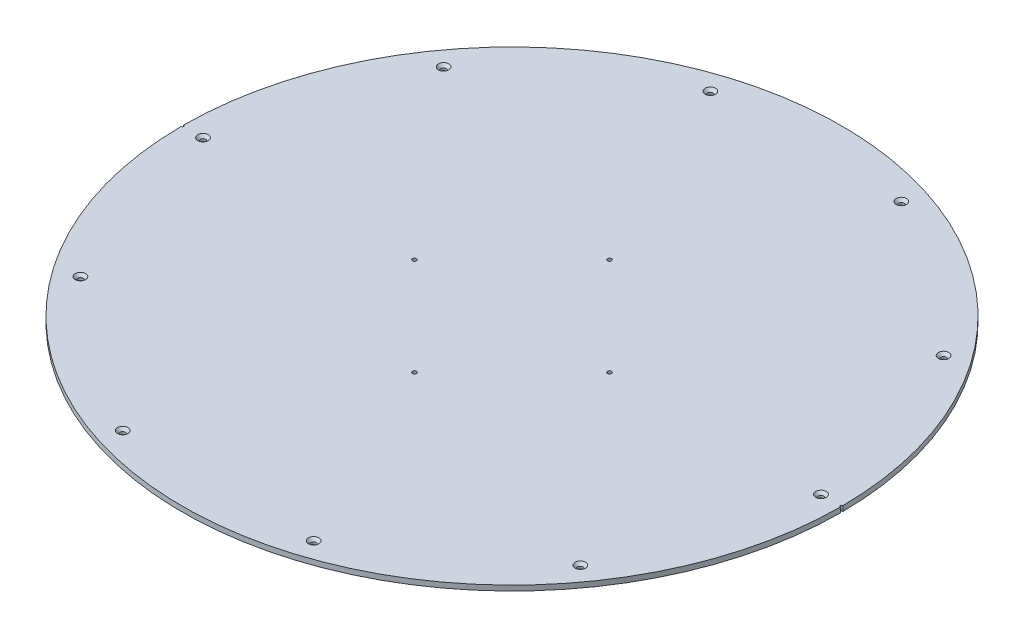
ISO-10303-21;
HEADER;
FILE_DESCRIPTION(('STEP AP214'),'2;1');
FILE_NAME('part.step','',(''),(''),'','','');
FILE_SCHEMA(('AUTOMOTIVE_DESIGN { 1 0 10303 214 1 1 1 1 }'));
ENDSEC;
DATA;
#1=APPLICATION_CONTEXT('core data for automotive mechanical design processes');
#2=APPLICATION_PROTOCOL_DEFINITION('international standard','automotive_design',2000,#1);
#3=PRODUCT_CONTEXT('',#1,'mechanical');
#4=PRODUCT('Part','Part','',(#3));
#5=PRODUCT_RELATED_PRODUCT_CATEGORY('part','',(#4));
#6=PRODUCT_DEFINITION_FORMATION('','',#4);
#7=PRODUCT_DEFINITION_CONTEXT('part definition',#1,'design');
#8=PRODUCT_DEFINITION('design','',#6,#7);
#9=PRODUCT_DEFINITION_SHAPE('','',#8);
#10=(LENGTH_UNIT() NAMED_UNIT(*) SI_UNIT(.MILLI.,.METRE.));
#11=(NAMED_UNIT(*) PLANE_ANGLE_UNIT() SI_UNIT($,.RADIAN.));
#12=(NAMED_UNIT(*) SI_UNIT($,.STERADIAN.) SOLID_ANGLE_UNIT());
#13=UNCERTAINTY_MEASURE_WITH_UNIT(LENGTH_MEASURE(1.E-05),#10,'distance_accuracy_value','');
#14=(GEOMETRIC_REPRESENTATION_CONTEXT(3) GLOBAL_UNCERTAINTY_ASSIGNED_CONTEXT((#13)) GLOBAL_UNIT_ASSIGNED_CONTEXT((#10,
#11,#12)) REPRESENTATION_CONTEXT('',''));
#15=CARTESIAN_POINT('',(0.,0.,0.));
#16=DIRECTION('',(0.,0.,1.));
#17=DIRECTION('',(1.,0.,0.));
#18=AXIS2_PLACEMENT_3D('',#15,#16,#17);
#19=CARTESIAN_POINT('',(0.,6.35,0.));
#20=DIRECTION('',(0.,-1.,0.));
#21=DIRECTION('',(0.,0.,-1.));
#22=AXIS2_PLACEMENT_3D('',#19,#20,#21);
#23=CYLINDRICAL_SURFACE('',#22,406.4);
#24=CARTESIAN_POINT('',(0.,0.,0.));
#25=DIRECTION('',(0.,1.,0.));
#26=DIRECTION('',(0.,0.,1.));
#27=AXIS2_PLACEMENT_3D('',#24,#25,#26);
#28=CIRCLE('',#27,406.4);
#29=CARTESIAN_POINT('',(406.396899414062,0.,-1.58749697208119));
#30=VERTEX_POINT('',#29);
#31=CARTESIAN_POINT('',(-406.396899414062,0.,-1.5874969720839));
#32=VERTEX_POINT('',#31);
#33=EDGE_CURVE('E833',#30,#32,#28,.T.);
#34=ORIENTED_EDGE('',*,*,#33,.T.);
#35=DIRECTION('',(0.,1.,0.));
#36=VECTOR('',#35,1.);
#37=CARTESIAN_POINT('',(-406.396899414062,3.175,-1.58749697208118));
#38=LINE('',#37,#36);
#39=CARTESIAN_POINT('',(-406.396899414062,6.35,-1.58749697208118));
#40=VERTEX_POINT('',#39);
#41=EDGE_CURVE('E790',#32,#40,#38,.T.);
#42=ORIENTED_EDGE('',*,*,#41,.T.);
#43=CARTESIAN_POINT('',(0.,6.35,0.));
#44=DIRECTION('',(0.,1.,0.));
#45=DIRECTION('',(0.,0.,1.));
#46=AXIS2_PLACEMENT_3D('',#43,#44,#45);
#47=CIRCLE('',#46,406.4);
#48=CARTESIAN_POINT('',(406.396899414062,6.35,-1.58749697208118));
#49=VERTEX_POINT('',#48);
#50=EDGE_CURVE('E843',#49,#40,#47,.T.);
#51=ORIENTED_EDGE('',*,*,#50,.F.);
#52=DIRECTION('',(0.,1.,0.));
#53=VECTOR('',#52,1.);
#54=CARTESIAN_POINT('',(406.396899414062,3.175,-1.58749697208118));
#55=LINE('',#54,#53);
#56=EDGE_CURVE('E783',#49,#30,#55,.F.);
#57=ORIENTED_EDGE('',*,*,#56,.T.);
#58=EDGE_LOOP('',(#34,#42,#51,#57));
#59=FACE_BOUND('',#58,.T.);
#60=ADVANCED_FACE('F775',(#59),#23,.T.);
#61=CARTESIAN_POINT('',(-406.396899414062,6.35,1.58749697208118));
#62=VERTEX_POINT('',#61);
#63=CARTESIAN_POINT('',(406.396899414062,6.35,1.58749697208118));
#64=VERTEX_POINT('',#63);
#65=EDGE_CURVE('E829',#62,#64,#47,.T.);
#66=ORIENTED_EDGE('',*,*,#65,.F.);
#67=DIRECTION('',(0.,1.,0.));
#68=VECTOR('',#67,1.);
#69=CARTESIAN_POINT('',(-406.396899414062,3.175,1.58749697208118));
#70=LINE('',#69,#68);
#71=CARTESIAN_POINT('',(-406.396899414062,0.,1.58749697208118));
#72=VERTEX_POINT('',#71);
#73=EDGE_CURVE('E817',#62,#72,#70,.F.);
#74=ORIENTED_EDGE('',*,*,#73,.T.);
#75=CARTESIAN_POINT('',(406.396899414062,0.,1.58749697208118));
#76=VERTEX_POINT('',#75);
#77=EDGE_CURVE('E828',#72,#76,#28,.T.);
#78=ORIENTED_EDGE('',*,*,#77,.T.);
#79=DIRECTION('',(0.,1.,0.));
#80=VECTOR('',#79,1.);
#81=CARTESIAN_POINT('',(406.396899414062,3.175,1.58749697208118));
#82=LINE('',#81,#80);
#83=EDGE_CURVE('E13',#76,#64,#82,.T.);
#84=ORIENTED_EDGE('',*,*,#83,.T.);
#85=EDGE_LOOP('',(#66,#74,#78,#84));
#86=FACE_BOUND('',#85,.T.);
#87=ADVANCED_FACE('F777',(#86),#23,.T.);
#88=CARTESIAN_POINT('',(0.,6.35,0.));
#89=DIRECTION('',(0.,1.,0.));
#90=DIRECTION('',(0.,0.,1.));
#91=AXIS2_PLACEMENT_3D('',#88,#89,#90);
#92=PLANE('',#91);
#93=CARTESIAN_POINT('',(-406.4,6.35,0.));
#94=DIRECTION('',(0.,1.,0.));
#95=DIRECTION('',(0.,0.,1.));
#96=AXIS2_PLACEMENT_3D('',#93,#94,#95);
#97=CIRCLE('',#96,1.58750000000002);
#98=EDGE_CURVE('E824',#62,#40,#97,.T.);
#99=ORIENTED_EDGE('',*,*,#98,.F.);
#100=ORIENTED_EDGE('',*,*,#65,.T.);
#101=CARTESIAN_POINT('',(406.4,6.35,0.));
#102=DIRECTION('',(0.,1.,0.));
#103=DIRECTION('',(0.,0.,1.));
#104=AXIS2_PLACEMENT_3D('',#101,#102,#103);
#105=CIRCLE('',#104,1.58750000000002);
#106=EDGE_CURVE('E854',#49,#64,#105,.T.);
#107=ORIENTED_EDGE('',*,*,#106,.F.);
#108=ORIENTED_EDGE('',*,*,#50,.T.);
#109=EDGE_LOOP('',(#99,#100,#107,#108));
#110=FACE_BOUND('',#109,.T.);
#111=CARTESIAN_POINT('',(6.4920291364956E-11,6.35,120.256299999965));
#112=DIRECTION('',(0.,1.,0.));
#113=DIRECTION('',(0.,0.,1.));
#114=AXIS2_PLACEMENT_3D('',#111,#112,#113);
#115=CIRCLE('',#114,2.45745);
#116=CARTESIAN_POINT('',(6.4920291364956E-11,6.35,122.713749999965));
#117=VERTEX_POINT('',#116);
#118=EDGE_CURVE('E868',#117,#117,#115,.T.);
#119=ORIENTED_EDGE('',*,*,#118,.F.);
#120=EDGE_LOOP('',(#119));
#121=FACE_BOUND('',#120,.T.);
#122=CARTESIAN_POINT('',(120.256300000029,6.35,4.19872627328201E-13));
#123=DIRECTION('',(0.,1.,0.));
#124=DIRECTION('',(0.,0.,1.));
#125=AXIS2_PLACEMENT_3D('',#122,#123,#124);
#126=CIRCLE('',#125,2.45745);
#127=CARTESIAN_POINT('',(120.256300000029,6.35,2.45745000000042));
#128=VERTEX_POINT('',#127);
#129=EDGE_CURVE('E877',#128,#128,#126,.T.);
#130=ORIENTED_EDGE('',*,*,#129,.F.);
#131=EDGE_LOOP('',(#130));
#132=FACE_BOUND('',#131,.T.);
#133=CARTESIAN_POINT('',(6.49064135771482E-11,6.35,-120.256299999965));
#134=DIRECTION('',(0.,1.,0.));
#135=DIRECTION('',(0.,0.,1.));
#136=AXIS2_PLACEMENT_3D('',#133,#134,#135);
#137=CIRCLE('',#136,2.45745);
#138=CARTESIAN_POINT('',(6.49064135771482E-11,6.35,-117.798849999965));
#139=VERTEX_POINT('',#138);
#140=EDGE_CURVE('E893',#139,#139,#137,.T.);
#141=ORIENTED_EDGE('',*,*,#140,.F.);
#142=EDGE_LOOP('',(#141));
#143=FACE_BOUND('',#142,.T.);
#144=CARTESIAN_POINT('',(-120.2562999999,6.35,0.));
#145=DIRECTION('',(0.,1.,0.));
#146=DIRECTION('',(0.,0.,1.));
#147=AXIS2_PLACEMENT_3D('',#144,#145,#146);
#148=CIRCLE('',#147,2.45745);
#149=CARTESIAN_POINT('',(-120.2562999999,6.35,2.45745000000001));
#150=VERTEX_POINT('',#149);
#151=EDGE_CURVE('E904',#150,#150,#148,.T.);
#152=ORIENTED_EDGE('',*,*,#151,.F.);
#153=EDGE_LOOP('',(#152));
#154=FACE_BOUND('',#153,.T.);
#155=CARTESIAN_POINT('',(117.735474856858,6.35,-362.352532708474));
#156=DIRECTION('',(0.,1.,0.));
#157=DIRECTION('',(0.,0.,1.));
#158=AXIS2_PLACEMENT_3D('',#155,#156,#157);
#159=CIRCLE('',#158,6.4389);
#160=CARTESIAN_POINT('',(117.735474856858,6.35,-355.913632708474));
#161=VERTEX_POINT('',#160);
#162=EDGE_CURVE('E913',#161,#161,#159,.T.);
#163=ORIENTED_EDGE('',*,*,#162,.F.);
#164=EDGE_LOOP('',(#163));
#165=FACE_BOUND('',#164,.T.);
#166=CARTESIAN_POINT('',(308.235474856882,6.35,-223.946181123485));
#167=DIRECTION('',(0.,1.,0.));
#168=DIRECTION('',(0.,0.,1.));
#169=AXIS2_PLACEMENT_3D('',#166,#167,#168);
#170=CIRCLE('',#169,6.43890000000003);
#171=CARTESIAN_POINT('',(308.235474856882,6.35,-217.507281123485));
#172=VERTEX_POINT('',#171);
#173=EDGE_CURVE('E926',#172,#172,#170,.T.);
#174=ORIENTED_EDGE('',*,*,#173,.F.);
#175=EDGE_LOOP('',(#174));
#176=FACE_BOUND('',#175,.T.);
#177=CARTESIAN_POINT('',(381.000000000065,6.35,-6.4925368714856E-11));
#178=DIRECTION('',(0.,1.,0.));
#179=DIRECTION('',(0.,0.,1.));
#180=AXIS2_PLACEMENT_3D('',#177,#178,#179);
#181=CIRCLE('',#180,6.43890000000003);
#182=CARTESIAN_POINT('',(381.000000000065,6.35,6.4388999999351));
#183=VERTEX_POINT('',#182);
#184=EDGE_CURVE('E938',#183,#183,#181,.T.);
#185=ORIENTED_EDGE('',*,*,#184,.F.);
#186=EDGE_LOOP('',(#185));
#187=FACE_BOUND('',#186,.T.);
#188=CARTESIAN_POINT('',(308.235474856958,6.35,223.94618112338));
#189=DIRECTION('',(0.,1.,0.));
#190=DIRECTION('',(0.,0.,1.));
#191=AXIS2_PLACEMENT_3D('',#188,#189,#190);
#192=CIRCLE('',#191,6.43890000000003);
#193=CARTESIAN_POINT('',(308.235474856958,6.35,230.38508112338));
#194=VERTEX_POINT('',#193);
#195=EDGE_CURVE('E952',#194,#194,#192,.T.);
#196=ORIENTED_EDGE('',*,*,#195,.F.);
#197=EDGE_LOOP('',(#196));
#198=FACE_BOUND('',#197,.T.);
#199=CARTESIAN_POINT('',(117.735474856982,6.35,362.352532708395));
#200=DIRECTION('',(0.,1.,0.));
#201=DIRECTION('',(0.,0.,1.));
#202=AXIS2_PLACEMENT_3D('',#199,#200,#201);
#203=CIRCLE('',#202,6.4389);
#204=CARTESIAN_POINT('',(117.735474856982,6.35,368.791432708395));
#205=VERTEX_POINT('',#204);
#206=EDGE_CURVE('E965',#205,#205,#203,.T.);
#207=ORIENTED_EDGE('',*,*,#206,.F.);
#208=EDGE_LOOP('',(#207));
#209=FACE_BOUND('',#208,.T.);
#210=CARTESIAN_POINT('',(-117.735474856728,6.35,362.352532708474));
#211=DIRECTION('',(0.,1.,0.));
#212=DIRECTION('',(0.,0.,1.));
#213=AXIS2_PLACEMENT_3D('',#210,#211,#212);
#214=CIRCLE('',#213,6.4389);
#215=CARTESIAN_POINT('',(-117.735474856728,6.35,368.791432708474));
#216=VERTEX_POINT('',#215);
#217=EDGE_CURVE('E977',#216,#216,#214,.T.);
#218=ORIENTED_EDGE('',*,*,#217,.F.);
#219=EDGE_LOOP('',(#218));
#220=FACE_BOUND('',#219,.T.);
#221=CARTESIAN_POINT('',(-308.235474856752,6.35,223.946181123485));
#222=DIRECTION('',(0.,1.,0.));
#223=DIRECTION('',(0.,0.,1.));
#224=AXIS2_PLACEMENT_3D('',#221,#222,#223);
#225=CIRCLE('',#224,6.43890000000003);
#226=CARTESIAN_POINT('',(-308.235474856752,6.35,230.385081123485));
#227=VERTEX_POINT('',#226);
#228=EDGE_CURVE('E991',#227,#227,#225,.T.);
#229=ORIENTED_EDGE('',*,*,#228,.F.);
#230=EDGE_LOOP('',(#229));
#231=FACE_BOUND('',#230,.T.);
#232=CARTESIAN_POINT('',(-380.999999999935,6.35,6.49720277579036E-11));
#233=DIRECTION('',(0.,1.,0.));
#234=DIRECTION('',(0.,0.,1.));
#235=AXIS2_PLACEMENT_3D('',#232,#233,#234);
#236=CIRCLE('',#235,6.43890000000003);
#237=CARTESIAN_POINT('',(-380.999999999935,6.35,6.438900000065));
#238=VERTEX_POINT('',#237);
#239=EDGE_CURVE('E1004',#238,#238,#236,.T.);
#240=ORIENTED_EDGE('',*,*,#239,.F.);
#241=EDGE_LOOP('',(#240));
#242=FACE_BOUND('',#241,.T.);
#243=CARTESIAN_POINT('',(-308.235474856828,6.35,-223.94618112338));
#244=DIRECTION('',(0.,1.,0.));
#245=DIRECTION('',(0.,0.,1.));
#246=AXIS2_PLACEMENT_3D('',#243,#244,#245);
#247=CIRCLE('',#246,6.43890000000003);
#248=CARTESIAN_POINT('',(-308.235474856828,6.35,-217.50728112338));
#249=VERTEX_POINT('',#248);
#250=EDGE_CURVE('E1012',#249,#249,#247,.T.);
#251=ORIENTED_EDGE('',*,*,#250,.F.);
#252=EDGE_LOOP('',(#251));
#253=FACE_BOUND('',#252,.T.);
#254=CARTESIAN_POINT('',(-117.735474856852,6.35,-362.352532708434));
#255=DIRECTION('',(0.,1.,0.));
#256=DIRECTION('',(0.,0.,1.));
#257=AXIS2_PLACEMENT_3D('',#254,#255,#256);
#258=CIRCLE('',#257,6.4389);
#259=CARTESIAN_POINT('',(-117.735474856852,6.35,-355.913632708433));
#260=VERTEX_POINT('',#259);
#261=EDGE_CURVE('E1026',#260,#260,#258,.T.);
#262=ORIENTED_EDGE('',*,*,#261,.F.);
#263=EDGE_LOOP('',(#262));
#264=FACE_BOUND('',#263,.T.);
#265=ADVANCED_FACE('F1039',(#110,#121,#132,#143,#154,#165,#176,#187,#198,#209,#220,#231,#242,
#253,#264),#92,.T.);
#266=CARTESIAN_POINT('',(0.,0.,0.));
#267=DIRECTION('',(0.,1.,0.));
#268=DIRECTION('',(0.,0.,1.));
#269=AXIS2_PLACEMENT_3D('',#266,#267,#268);
#270=PLANE('',#269);
#271=CARTESIAN_POINT('',(6.4920291364956E-11,0.,120.256299999965));
#272=DIRECTION('',(0.,1.,0.));
#273=DIRECTION('',(0.,0.,1.));
#274=AXIS2_PLACEMENT_3D('',#271,#272,#273);
#275=CIRCLE('',#274,2.45745);
#276=CARTESIAN_POINT('',(6.4920291364956E-11,0.,122.713749999965));
#277=VERTEX_POINT('',#276);
#278=EDGE_CURVE('E873',#277,#277,#275,.T.);
#279=ORIENTED_EDGE('',*,*,#278,.T.);
#280=EDGE_LOOP('',(#279));
#281=FACE_BOUND('',#280,.T.);
#282=CARTESIAN_POINT('',(120.256300000029,0.,4.19872627328201E-13));
#283=DIRECTION('',(0.,1.,0.));
#284=DIRECTION('',(0.,0.,1.));
#285=AXIS2_PLACEMENT_3D('',#282,#283,#284);
#286=CIRCLE('',#285,2.45745);
#287=CARTESIAN_POINT('',(120.256300000029,0.,2.45745000000042));
#288=VERTEX_POINT('',#287);
#289=EDGE_CURVE('E888',#288,#288,#286,.T.);
#290=ORIENTED_EDGE('',*,*,#289,.T.);
#291=EDGE_LOOP('',(#290));
#292=FACE_BOUND('',#291,.T.);
#293=CARTESIAN_POINT('',(6.49064135771482E-11,0.,-120.256299999965));
#294=DIRECTION('',(0.,1.,0.));
#295=DIRECTION('',(0.,0.,1.));
#296=AXIS2_PLACEMENT_3D('',#293,#294,#295);
#297=CIRCLE('',#296,2.45745);
#298=CARTESIAN_POINT('',(6.49064135771482E-11,0.,-117.798849999965));
#299=VERTEX_POINT('',#298);
#300=EDGE_CURVE('E897',#299,#299,#297,.T.);
#301=ORIENTED_EDGE('',*,*,#300,.T.);
#302=EDGE_LOOP('',(#301));
#303=FACE_BOUND('',#302,.T.);
#304=CARTESIAN_POINT('',(-120.2562999999,0.,0.));
#305=DIRECTION('',(0.,1.,0.));
#306=DIRECTION('',(0.,0.,1.));
#307=AXIS2_PLACEMENT_3D('',#304,#305,#306);
#308=CIRCLE('',#307,2.45745);
#309=CARTESIAN_POINT('',(-120.2562999999,0.,2.45745000000001));
#310=VERTEX_POINT('',#309);
#311=EDGE_CURVE('E909',#310,#310,#308,.T.);
#312=ORIENTED_EDGE('',*,*,#311,.T.);
#313=EDGE_LOOP('',(#312));
#314=FACE_BOUND('',#313,.T.);
#315=CARTESIAN_POINT('',(117.735474856858,0.,-362.352532708474));
#316=DIRECTION('',(0.,1.,0.));
#317=DIRECTION('',(0.,0.,1.));
#318=AXIS2_PLACEMENT_3D('',#315,#316,#317);
#319=CIRCLE('',#318,3.3782);
#320=CARTESIAN_POINT('',(117.735474856858,0.,-358.974332708474));
#321=VERTEX_POINT('',#320);
#322=EDGE_CURVE('E921',#321,#321,#319,.T.);
#323=ORIENTED_EDGE('',*,*,#322,.T.);
#324=EDGE_LOOP('',(#323));
#325=FACE_BOUND('',#324,.T.);
#326=CARTESIAN_POINT('',(308.235474856882,0.,-223.946181123485));
#327=DIRECTION('',(0.,1.,0.));
#328=DIRECTION('',(0.,0.,1.));
#329=AXIS2_PLACEMENT_3D('',#326,#327,#328);
#330=CIRCLE('',#329,3.3782);
#331=CARTESIAN_POINT('',(308.235474856882,0.,-220.567981123485));
#332=VERTEX_POINT('',#331);
#333=EDGE_CURVE('E944',#332,#332,#330,.T.);
#334=ORIENTED_EDGE('',*,*,#333,.T.);
#335=EDGE_LOOP('',(#334));
#336=FACE_BOUND('',#335,.T.);
#337=CARTESIAN_POINT('',(381.000000000065,0.,-6.4925368714856E-11));
#338=DIRECTION('',(0.,1.,0.));
#339=DIRECTION('',(0.,0.,1.));
#340=AXIS2_PLACEMENT_3D('',#337,#338,#339);
#341=CIRCLE('',#340,3.3782);
#342=CARTESIAN_POINT('',(381.000000000065,0.,3.37819999993507));
#343=VERTEX_POINT('',#342);
#344=EDGE_CURVE('E948',#343,#343,#341,.T.);
#345=ORIENTED_EDGE('',*,*,#344,.T.);
#346=EDGE_LOOP('',(#345));
#347=FACE_BOUND('',#346,.T.);
#348=CARTESIAN_POINT('',(308.235474856958,0.,223.94618112338));
#349=DIRECTION('',(0.,1.,0.));
#350=DIRECTION('',(0.,0.,1.));
#351=AXIS2_PLACEMENT_3D('',#348,#349,#350);
#352=CIRCLE('',#351,3.3782);
#353=CARTESIAN_POINT('',(308.235474856958,0.,227.32438112338));
#354=VERTEX_POINT('',#353);
#355=EDGE_CURVE('E960',#354,#354,#352,.T.);
#356=ORIENTED_EDGE('',*,*,#355,.T.);
#357=EDGE_LOOP('',(#356));
#358=FACE_BOUND('',#357,.T.);
#359=CARTESIAN_POINT('',(117.735474856982,0.,362.352532708395));
#360=DIRECTION('',(0.,1.,0.));
#361=DIRECTION('',(0.,0.,1.));
#362=AXIS2_PLACEMENT_3D('',#359,#360,#361);
#363=CIRCLE('',#362,3.3782);
#364=CARTESIAN_POINT('',(117.735474856982,0.,365.730732708395));
#365=VERTEX_POINT('',#364);
#366=EDGE_CURVE('E983',#365,#365,#363,.T.);
#367=ORIENTED_EDGE('',*,*,#366,.T.);
#368=EDGE_LOOP('',(#367));
#369=FACE_BOUND('',#368,.T.);
#370=CARTESIAN_POINT('',(-117.735474856728,0.,362.352532708474));
#371=DIRECTION('',(0.,1.,0.));
#372=DIRECTION('',(0.,0.,1.));
#373=AXIS2_PLACEMENT_3D('',#370,#371,#372);
#374=CIRCLE('',#373,3.3782);
#375=CARTESIAN_POINT('',(-117.735474856728,0.,365.730732708474));
#376=VERTEX_POINT('',#375);
#377=EDGE_CURVE('E987',#376,#376,#374,.T.);
#378=ORIENTED_EDGE('',*,*,#377,.T.);
#379=EDGE_LOOP('',(#378));
#380=FACE_BOUND('',#379,.T.);
#381=CARTESIAN_POINT('',(-308.235474856752,0.,223.946181123485));
#382=DIRECTION('',(0.,1.,0.));
#383=DIRECTION('',(0.,0.,1.));
#384=AXIS2_PLACEMENT_3D('',#381,#382,#383);
#385=CIRCLE('',#384,3.3782);
#386=CARTESIAN_POINT('',(-308.235474856752,0.,227.324381123485));
#387=VERTEX_POINT('',#386);
#388=EDGE_CURVE('E999',#387,#387,#385,.T.);
#389=ORIENTED_EDGE('',*,*,#388,.T.);
#390=EDGE_LOOP('',(#389));
#391=FACE_BOUND('',#390,.T.);
#392=CARTESIAN_POINT('',(-380.999999999935,0.,6.49720277579036E-11));
#393=DIRECTION('',(0.,1.,0.));
#394=DIRECTION('',(0.,0.,1.));
#395=AXIS2_PLACEMENT_3D('',#392,#393,#394);
#396=CIRCLE('',#395,3.3782);
#397=CARTESIAN_POINT('',(-380.999999999935,0.,3.37820000006497));
#398=VERTEX_POINT('',#397);
#399=EDGE_CURVE('E1018',#398,#398,#396,.T.);
#400=ORIENTED_EDGE('',*,*,#399,.T.);
#401=EDGE_LOOP('',(#400));
#402=FACE_BOUND('',#401,.T.);
#403=CARTESIAN_POINT('',(-308.235474856828,0.,-223.94618112338));
#404=DIRECTION('',(0.,1.,0.));
#405=DIRECTION('',(0.,0.,1.));
#406=AXIS2_PLACEMENT_3D('',#403,#404,#405);
#407=CIRCLE('',#406,3.3782);
#408=CARTESIAN_POINT('',(-308.235474856828,0.,-220.56798112338));
#409=VERTEX_POINT('',#408);
#410=EDGE_CURVE('E1022',#409,#409,#407,.T.);
#411=ORIENTED_EDGE('',*,*,#410,.T.);
#412=EDGE_LOOP('',(#411));
#413=FACE_BOUND('',#412,.T.);
#414=CARTESIAN_POINT('',(-117.735474856852,0.,-362.352532708434));
#415=DIRECTION('',(0.,1.,0.));
#416=DIRECTION('',(0.,0.,1.));
#417=AXIS2_PLACEMENT_3D('',#414,#415,#416);
#418=CIRCLE('',#417,3.3782);
#419=CARTESIAN_POINT('',(-117.735474856852,0.,-358.974332708434));
#420=VERTEX_POINT('',#419);
#421=EDGE_CURVE('E834',#420,#420,#418,.T.);
#422=ORIENTED_EDGE('',*,*,#421,.T.);
#423=EDGE_LOOP('',(#422));
#424=FACE_BOUND('',#423,.T.);
#425=ORIENTED_EDGE('',*,*,#77,.F.);
#426=CARTESIAN_POINT('',(-406.4,0.,0.));
#427=DIRECTION('',(0.,1.,0.));
#428=DIRECTION('',(0.,0.,1.));
#429=AXIS2_PLACEMENT_3D('',#426,#427,#428);
#430=CIRCLE('',#429,1.58750000000002);
#431=EDGE_CURVE('E814',#72,#32,#430,.T.);
#432=ORIENTED_EDGE('',*,*,#431,.T.);
#433=ORIENTED_EDGE('',*,*,#33,.F.);
#434=CARTESIAN_POINT('',(406.4,0.,0.));
#435=DIRECTION('',(0.,1.,0.));
#436=DIRECTION('',(0.,0.,1.));
#437=AXIS2_PLACEMENT_3D('',#434,#435,#436);
#438=CIRCLE('',#437,1.58750000000002);
#439=EDGE_CURVE('E798',#30,#76,#438,.T.);
#440=ORIENTED_EDGE('',*,*,#439,.T.);
#441=EDGE_LOOP('',(#425,#432,#433,#440));
#442=FACE_BOUND('',#441,.T.);
#443=ADVANCED_FACE('F831',(#281,#292,#303,#314,#325,#336,#347,#358,#369,#380,#391,#402,#413,
#424,#442),#270,.F.);
#444=CARTESIAN_POINT('',(-117.735474856852,6.35,-362.352532708434));
#445=DIRECTION('',(0.,1.,0.));
#446=DIRECTION('',(0.,0.,1.));
#447=AXIS2_PLACEMENT_3D('',#444,#445,#446);
#448=CYLINDRICAL_SURFACE('',#447,3.3782);
#449=ORIENTED_EDGE('',*,*,#421,.F.);
#450=EDGE_LOOP('',(#449));
#451=FACE_BOUND('',#450,.T.);
#452=CARTESIAN_POINT('',(-117.735474856852,2.82906741601866,-362.352532708434));
#453=DIRECTION('',(0.,1.,0.));
#454=DIRECTION('',(0.,0.,1.));
#455=AXIS2_PLACEMENT_3D('',#452,#453,#454);
#456=CIRCLE('',#455,3.3782);
#457=CARTESIAN_POINT('',(-117.735474856852,2.82906741601866,-358.974332708434));
#458=VERTEX_POINT('',#457);
#459=EDGE_CURVE('E839',#458,#458,#456,.T.);
#460=ORIENTED_EDGE('',*,*,#459,.T.);
#461=EDGE_LOOP('',(#460));
#462=FACE_BOUND('',#461,.T.);
#463=ADVANCED_FACE('F1047',(#451,#462),#448,.F.);
#464=CARTESIAN_POINT('',(-117.735474856852,6.35,-362.352532708434));
#465=DIRECTION('',(0.,1.,0.));
#466=DIRECTION('',(0.,0.,1.));
#467=AXIS2_PLACEMENT_3D('',#464,#465,#466);
#468=CONICAL_SURFACE('',#467,6.4389,0.715584993317675);
#469=ORIENTED_EDGE('',*,*,#459,.F.);
#470=EDGE_LOOP('',(#469));
#471=FACE_BOUND('',#470,.T.);
#472=ORIENTED_EDGE('',*,*,#261,.T.);
#473=EDGE_LOOP('',(#472));
#474=FACE_BOUND('',#473,.T.);
#475=ADVANCED_FACE('F1037',(#471,#474),#468,.F.);
#476=CARTESIAN_POINT('',(-308.235474856828,6.35,-223.94618112338));
#477=DIRECTION('',(0.,1.,0.));
#478=DIRECTION('',(0.,0.,1.));
#479=AXIS2_PLACEMENT_3D('',#476,#477,#478);
#480=CYLINDRICAL_SURFACE('',#479,3.3782);
#481=ORIENTED_EDGE('',*,*,#410,.F.);
#482=EDGE_LOOP('',(#481));
#483=FACE_BOUND('',#482,.T.);
#484=CARTESIAN_POINT('',(-308.235474856828,2.82906741601866,-223.94618112338));
#485=DIRECTION('',(0.,1.,0.));
#486=DIRECTION('',(0.,0.,1.));
#487=AXIS2_PLACEMENT_3D('',#484,#485,#486);
#488=CIRCLE('',#487,3.3782);
#489=CARTESIAN_POINT('',(-308.235474856828,2.82906741601866,-220.56798112338));
#490=VERTEX_POINT('',#489);
#491=EDGE_CURVE('E1017',#490,#490,#488,.T.);
#492=ORIENTED_EDGE('',*,*,#491,.T.);
#493=EDGE_LOOP('',(#492));
#494=FACE_BOUND('',#493,.T.);
#495=ADVANCED_FACE('F1152',(#483,#494),#480,.F.);
#496=CARTESIAN_POINT('',(-308.235474856828,6.35,-223.94618112338));
#497=DIRECTION('',(0.,1.,0.));
#498=DIRECTION('',(0.,0.,1.));
#499=AXIS2_PLACEMENT_3D('',#496,#497,#498);
#500=CONICAL_SURFACE('',#499,6.43890000000003,0.715584993317679);
#501=ORIENTED_EDGE('',*,*,#491,.F.);
#502=EDGE_LOOP('',(#501));
#503=FACE_BOUND('',#502,.T.);
#504=ORIENTED_EDGE('',*,*,#250,.T.);
#505=EDGE_LOOP('',(#504));
#506=FACE_BOUND('',#505,.T.);
#507=ADVANCED_FACE('F1148',(#503,#506),#500,.F.);
#508=CARTESIAN_POINT('',(-380.999999999935,6.35,6.49720277579036E-11));
#509=DIRECTION('',(0.,1.,0.));
#510=DIRECTION('',(0.,0.,1.));
#511=AXIS2_PLACEMENT_3D('',#508,#509,#510);
#512=CYLINDRICAL_SURFACE('',#511,3.3782);
#513=ORIENTED_EDGE('',*,*,#399,.F.);
#514=EDGE_LOOP('',(#513));
#515=FACE_BOUND('',#514,.T.);
#516=CARTESIAN_POINT('',(-380.999999999935,2.82906741601866,6.49720277579036E-11));
#517=DIRECTION('',(0.,1.,0.));
#518=DIRECTION('',(0.,0.,1.));
#519=AXIS2_PLACEMENT_3D('',#516,#517,#518);
#520=CIRCLE('',#519,3.3782);
#521=CARTESIAN_POINT('',(-380.999999999935,2.82906741601866,3.37820000006497));
#522=VERTEX_POINT('',#521);
#523=EDGE_CURVE('E1010',#522,#522,#520,.T.);
#524=ORIENTED_EDGE('',*,*,#523,.T.);
#525=EDGE_LOOP('',(#524));
#526=FACE_BOUND('',#525,.T.);
#527=ADVANCED_FACE('F1144',(#515,#526),#512,.F.);
#528=CARTESIAN_POINT('',(-380.999999999935,6.35,6.49720277579036E-11));
#529=DIRECTION('',(0.,1.,0.));
#530=DIRECTION('',(0.,0.,1.));
#531=AXIS2_PLACEMENT_3D('',#528,#529,#530);
#532=CONICAL_SURFACE('',#531,6.43890000000003,0.715584993317679);
#533=ORIENTED_EDGE('',*,*,#523,.F.);
#534=EDGE_LOOP('',(#533));
#535=FACE_BOUND('',#534,.T.);
#536=ORIENTED_EDGE('',*,*,#239,.T.);
#537=EDGE_LOOP('',(#536));
#538=FACE_BOUND('',#537,.T.);
#539=ADVANCED_FACE('F1140',(#535,#538),#532,.F.);
#540=CARTESIAN_POINT('',(-308.235474856752,6.35,223.946181123485));
#541=DIRECTION('',(0.,1.,0.));
#542=DIRECTION('',(0.,0.,1.));
#543=AXIS2_PLACEMENT_3D('',#540,#541,#542);
#544=CYLINDRICAL_SURFACE('',#543,3.3782);
#545=ORIENTED_EDGE('',*,*,#388,.F.);
#546=EDGE_LOOP('',(#545));
#547=FACE_BOUND('',#546,.T.);
#548=CARTESIAN_POINT('',(-308.235474856752,2.82906741601866,223.946181123485));
#549=DIRECTION('',(0.,1.,0.));
#550=DIRECTION('',(0.,0.,1.));
#551=AXIS2_PLACEMENT_3D('',#548,#549,#550);
#552=CIRCLE('',#551,3.3782);
#553=CARTESIAN_POINT('',(-308.235474856752,2.82906741601866,227.324381123485));
#554=VERTEX_POINT('',#553);
#555=EDGE_CURVE('E1005',#554,#554,#552,.T.);
#556=ORIENTED_EDGE('',*,*,#555,.T.);
#557=EDGE_LOOP('',(#556));
#558=FACE_BOUND('',#557,.T.);
#559=ADVANCED_FACE('F1136',(#547,#558),#544,.F.);
#560=CARTESIAN_POINT('',(-308.235474856752,6.35,223.946181123485));
#561=DIRECTION('',(0.,1.,0.));
#562=DIRECTION('',(0.,0.,1.));
#563=AXIS2_PLACEMENT_3D('',#560,#561,#562);
#564=CONICAL_SURFACE('',#563,6.43890000000003,0.715584993317679);
#565=ORIENTED_EDGE('',*,*,#555,.F.);
#566=EDGE_LOOP('',(#565));
#567=FACE_BOUND('',#566,.T.);
#568=ORIENTED_EDGE('',*,*,#228,.T.);
#569=EDGE_LOOP('',(#568));
#570=FACE_BOUND('',#569,.T.);
#571=ADVANCED_FACE('F1132',(#567,#570),#564,.F.);
#572=CARTESIAN_POINT('',(-117.735474856728,6.35,362.352532708474));
#573=DIRECTION('',(0.,1.,0.));
#574=DIRECTION('',(0.,0.,1.));
#575=AXIS2_PLACEMENT_3D('',#572,#573,#574);
#576=CYLINDRICAL_SURFACE('',#575,3.3782);
#577=ORIENTED_EDGE('',*,*,#377,.F.);
#578=EDGE_LOOP('',(#577));
#579=FACE_BOUND('',#578,.T.);
#580=CARTESIAN_POINT('',(-117.735474856728,2.82906741601866,362.352532708474));
#581=DIRECTION('',(0.,1.,0.));
#582=DIRECTION('',(0.,0.,1.));
#583=AXIS2_PLACEMENT_3D('',#580,#581,#582);
#584=CIRCLE('',#583,3.3782);
#585=CARTESIAN_POINT('',(-117.735474856728,2.82906741601866,365.730732708474));
#586=VERTEX_POINT('',#585);
#587=EDGE_CURVE('E982',#586,#586,#584,.T.);
#588=ORIENTED_EDGE('',*,*,#587,.T.);
#589=EDGE_LOOP('',(#588));
#590=FACE_BOUND('',#589,.T.);
#591=ADVANCED_FACE('F1128',(#579,#590),#576,.F.);
#592=CARTESIAN_POINT('',(-117.735474856728,6.35,362.352532708474));
#593=DIRECTION('',(0.,1.,0.));
#594=DIRECTION('',(0.,0.,1.));
#595=AXIS2_PLACEMENT_3D('',#592,#593,#594);
#596=CONICAL_SURFACE('',#595,6.4389,0.715584993317675);
#597=ORIENTED_EDGE('',*,*,#587,.F.);
#598=EDGE_LOOP('',(#597));
#599=FACE_BOUND('',#598,.T.);
#600=ORIENTED_EDGE('',*,*,#217,.T.);
#601=EDGE_LOOP('',(#600));
#602=FACE_BOUND('',#601,.T.);
#603=ADVANCED_FACE('F1124',(#599,#602),#596,.F.);
#604=CARTESIAN_POINT('',(117.735474856982,6.35,362.352532708395));
#605=DIRECTION('',(0.,1.,0.));
#606=DIRECTION('',(0.,0.,1.));
#607=AXIS2_PLACEMENT_3D('',#604,#605,#606);
#608=CYLINDRICAL_SURFACE('',#607,3.3782);
#609=ORIENTED_EDGE('',*,*,#366,.F.);
#610=EDGE_LOOP('',(#609));
#611=FACE_BOUND('',#610,.T.);
#612=CARTESIAN_POINT('',(117.735474856982,2.82906741601866,362.352532708395));
#613=DIRECTION('',(0.,1.,0.));
#614=DIRECTION('',(0.,0.,1.));
#615=AXIS2_PLACEMENT_3D('',#612,#613,#614);
#616=CIRCLE('',#615,3.3782);
#617=CARTESIAN_POINT('',(117.735474856982,2.82906741601866,365.730732708395));
#618=VERTEX_POINT('',#617);
#619=EDGE_CURVE('E971',#618,#618,#616,.T.);
#620=ORIENTED_EDGE('',*,*,#619,.T.);
#621=EDGE_LOOP('',(#620));
#622=FACE_BOUND('',#621,.T.);
#623=ADVANCED_FACE('F1120',(#611,#622),#608,.F.);
#624=CARTESIAN_POINT('',(117.735474856982,6.35,362.352532708395));
#625=DIRECTION('',(0.,1.,0.));
#626=DIRECTION('',(0.,0.,1.));
#627=AXIS2_PLACEMENT_3D('',#624,#625,#626);
#628=CONICAL_SURFACE('',#627,6.4389,0.715584993317675);
#629=ORIENTED_EDGE('',*,*,#619,.F.);
#630=EDGE_LOOP('',(#629));
#631=FACE_BOUND('',#630,.T.);
#632=ORIENTED_EDGE('',*,*,#206,.T.);
#633=EDGE_LOOP('',(#632));
#634=FACE_BOUND('',#633,.T.);
#635=ADVANCED_FACE('F1116',(#631,#634),#628,.F.);
#636=CARTESIAN_POINT('',(308.235474856958,6.35,223.94618112338));
#637=DIRECTION('',(0.,1.,0.));
#638=DIRECTION('',(0.,0.,1.));
#639=AXIS2_PLACEMENT_3D('',#636,#637,#638);
#640=CYLINDRICAL_SURFACE('',#639,3.3782);
#641=ORIENTED_EDGE('',*,*,#355,.F.);
#642=EDGE_LOOP('',(#641));
#643=FACE_BOUND('',#642,.T.);
#644=CARTESIAN_POINT('',(308.235474856958,2.82906741601866,223.94618112338));
#645=DIRECTION('',(0.,1.,0.));
#646=DIRECTION('',(0.,0.,1.));
#647=AXIS2_PLACEMENT_3D('',#644,#645,#646);
#648=CIRCLE('',#647,3.3782);
#649=CARTESIAN_POINT('',(308.235474856958,2.82906741601866,227.32438112338));
#650=VERTEX_POINT('',#649);
#651=EDGE_CURVE('E966',#650,#650,#648,.T.);
#652=ORIENTED_EDGE('',*,*,#651,.T.);
#653=EDGE_LOOP('',(#652));
#654=FACE_BOUND('',#653,.T.);
#655=ADVANCED_FACE('F1112',(#643,#654),#640,.F.);
#656=CARTESIAN_POINT('',(308.235474856958,6.35,223.94618112338));
#657=DIRECTION('',(0.,1.,0.));
#658=DIRECTION('',(0.,0.,1.));
#659=AXIS2_PLACEMENT_3D('',#656,#657,#658);
#660=CONICAL_SURFACE('',#659,6.43890000000003,0.715584993317679);
#661=ORIENTED_EDGE('',*,*,#651,.F.);
#662=EDGE_LOOP('',(#661));
#663=FACE_BOUND('',#662,.T.);
#664=ORIENTED_EDGE('',*,*,#195,.T.);
#665=EDGE_LOOP('',(#664));
#666=FACE_BOUND('',#665,.T.);
#667=ADVANCED_FACE('F1108',(#663,#666),#660,.F.);
#668=CARTESIAN_POINT('',(381.000000000065,6.35,-6.4925368714856E-11));
#669=DIRECTION('',(0.,1.,0.));
#670=DIRECTION('',(0.,0.,1.));
#671=AXIS2_PLACEMENT_3D('',#668,#669,#670);
#672=CYLINDRICAL_SURFACE('',#671,3.3782);
#673=ORIENTED_EDGE('',*,*,#344,.F.);
#674=EDGE_LOOP('',(#673));
#675=FACE_BOUND('',#674,.T.);
#676=CARTESIAN_POINT('',(381.000000000065,2.82906741601866,-6.4925368714856E-11));
#677=DIRECTION('',(0.,1.,0.));
#678=DIRECTION('',(0.,0.,1.));
#679=AXIS2_PLACEMENT_3D('',#676,#677,#678);
#680=CIRCLE('',#679,3.3782);
#681=CARTESIAN_POINT('',(381.000000000065,2.82906741601866,3.37819999993507));
#682=VERTEX_POINT('',#681);
#683=EDGE_CURVE('E943',#682,#682,#680,.T.);
#684=ORIENTED_EDGE('',*,*,#683,.T.);
#685=EDGE_LOOP('',(#684));
#686=FACE_BOUND('',#685,.T.);
#687=ADVANCED_FACE('F1104',(#675,#686),#672,.F.);
#688=CARTESIAN_POINT('',(381.000000000065,6.35,-6.4925368714856E-11));
#689=DIRECTION('',(0.,1.,0.));
#690=DIRECTION('',(0.,0.,1.));
#691=AXIS2_PLACEMENT_3D('',#688,#689,#690);
#692=CONICAL_SURFACE('',#691,6.43890000000003,0.715584993317679);
#693=ORIENTED_EDGE('',*,*,#683,.F.);
#694=EDGE_LOOP('',(#693));
#695=FACE_BOUND('',#694,.T.);
#696=ORIENTED_EDGE('',*,*,#184,.T.);
#697=EDGE_LOOP('',(#696));
#698=FACE_BOUND('',#697,.T.);
#699=ADVANCED_FACE('F1100',(#695,#698),#692,.F.);
#700=CARTESIAN_POINT('',(308.235474856882,6.35,-223.946181123485));
#701=DIRECTION('',(0.,1.,0.));
#702=DIRECTION('',(0.,0.,1.));
#703=AXIS2_PLACEMENT_3D('',#700,#701,#702);
#704=CYLINDRICAL_SURFACE('',#703,3.3782);
#705=ORIENTED_EDGE('',*,*,#333,.F.);
#706=EDGE_LOOP('',(#705));
#707=FACE_BOUND('',#706,.T.);
#708=CARTESIAN_POINT('',(308.235474856882,2.82906741601866,-223.946181123485));
#709=DIRECTION('',(0.,1.,0.));
#710=DIRECTION('',(0.,0.,1.));
#711=AXIS2_PLACEMENT_3D('',#708,#709,#710);
#712=CIRCLE('',#711,3.3782);
#713=CARTESIAN_POINT('',(308.235474856882,2.82906741601866,-220.567981123485));
#714=VERTEX_POINT('',#713);
#715=EDGE_CURVE('E932',#714,#714,#712,.T.);
#716=ORIENTED_EDGE('',*,*,#715,.T.);
#717=EDGE_LOOP('',(#716));
#718=FACE_BOUND('',#717,.T.);
#719=ADVANCED_FACE('F1096',(#707,#718),#704,.F.);
#720=CARTESIAN_POINT('',(308.235474856882,6.35,-223.946181123485));
#721=DIRECTION('',(0.,1.,0.));
#722=DIRECTION('',(0.,0.,1.));
#723=AXIS2_PLACEMENT_3D('',#720,#721,#722);
#724=CONICAL_SURFACE('',#723,6.43890000000003,0.715584993317679);
#725=ORIENTED_EDGE('',*,*,#715,.F.);
#726=EDGE_LOOP('',(#725));
#727=FACE_BOUND('',#726,.T.);
#728=ORIENTED_EDGE('',*,*,#173,.T.);
#729=EDGE_LOOP('',(#728));
#730=FACE_BOUND('',#729,.T.);
#731=ADVANCED_FACE('F1092',(#727,#730),#724,.F.);
#732=CARTESIAN_POINT('',(117.735474856858,6.35,-362.352532708474));
#733=DIRECTION('',(0.,1.,0.));
#734=DIRECTION('',(0.,0.,1.));
#735=AXIS2_PLACEMENT_3D('',#732,#733,#734);
#736=CYLINDRICAL_SURFACE('',#735,3.3782);
#737=ORIENTED_EDGE('',*,*,#322,.F.);
#738=EDGE_LOOP('',(#737));
#739=FACE_BOUND('',#738,.T.);
#740=CARTESIAN_POINT('',(117.735474856858,2.82906741601866,-362.352532708474));
#741=DIRECTION('',(0.,1.,0.));
#742=DIRECTION('',(0.,0.,1.));
#743=AXIS2_PLACEMENT_3D('',#740,#741,#742);
#744=CIRCLE('',#743,3.3782);
#745=CARTESIAN_POINT('',(117.735474856858,2.82906741601866,-358.974332708474));
#746=VERTEX_POINT('',#745);
#747=EDGE_CURVE('E927',#746,#746,#744,.T.);
#748=ORIENTED_EDGE('',*,*,#747,.T.);
#749=EDGE_LOOP('',(#748));
#750=FACE_BOUND('',#749,.T.);
#751=ADVANCED_FACE('F1088',(#739,#750),#736,.F.);
#752=CARTESIAN_POINT('',(117.735474856858,6.35,-362.352532708474));
#753=DIRECTION('',(0.,1.,0.));
#754=DIRECTION('',(0.,0.,1.));
#755=AXIS2_PLACEMENT_3D('',#752,#753,#754);
#756=CONICAL_SURFACE('',#755,6.4389,0.715584993317675);
#757=ORIENTED_EDGE('',*,*,#747,.F.);
#758=EDGE_LOOP('',(#757));
#759=FACE_BOUND('',#758,.T.);
#760=ORIENTED_EDGE('',*,*,#162,.T.);
#761=EDGE_LOOP('',(#760));
#762=FACE_BOUND('',#761,.T.);
#763=ADVANCED_FACE('F1084',(#759,#762),#756,.F.);
#764=CARTESIAN_POINT('',(-120.2562999999,6.35,0.));
#765=DIRECTION('',(0.,1.,0.));
#766=DIRECTION('',(0.,0.,1.));
#767=AXIS2_PLACEMENT_3D('',#764,#765,#766);
#768=CYLINDRICAL_SURFACE('',#767,2.45745);
#769=ORIENTED_EDGE('',*,*,#311,.F.);
#770=EDGE_LOOP('',(#769));
#771=FACE_BOUND('',#770,.T.);
#772=ORIENTED_EDGE('',*,*,#151,.T.);
#773=EDGE_LOOP('',(#772));
#774=FACE_BOUND('',#773,.T.);
#775=ADVANCED_FACE('F1080',(#771,#774),#768,.F.);
#776=CARTESIAN_POINT('',(6.49064135771482E-11,6.35,-120.256299999965));
#777=DIRECTION('',(0.,1.,0.));
#778=DIRECTION('',(0.,0.,1.));
#779=AXIS2_PLACEMENT_3D('',#776,#777,#778);
#780=CYLINDRICAL_SURFACE('',#779,2.45745);
#781=ORIENTED_EDGE('',*,*,#300,.F.);
#782=EDGE_LOOP('',(#781));
#783=FACE_BOUND('',#782,.T.);
#784=ORIENTED_EDGE('',*,*,#140,.T.);
#785=EDGE_LOOP('',(#784));
#786=FACE_BOUND('',#785,.T.);
#787=ADVANCED_FACE('F1076',(#783,#786),#780,.F.);
#788=CARTESIAN_POINT('',(120.256300000029,6.35,4.19872627328201E-13));
#789=DIRECTION('',(0.,1.,0.));
#790=DIRECTION('',(0.,0.,1.));
#791=AXIS2_PLACEMENT_3D('',#788,#789,#790);
#792=CYLINDRICAL_SURFACE('',#791,2.45745);
#793=ORIENTED_EDGE('',*,*,#289,.F.);
#794=EDGE_LOOP('',(#793));
#795=FACE_BOUND('',#794,.T.);
#796=ORIENTED_EDGE('',*,*,#129,.T.);
#797=EDGE_LOOP('',(#796));
#798=FACE_BOUND('',#797,.T.);
#799=ADVANCED_FACE('F1070',(#795,#798),#792,.F.);
#800=CARTESIAN_POINT('',(6.4920291364956E-11,6.35,120.256299999965));
#801=DIRECTION('',(0.,1.,0.));
#802=DIRECTION('',(0.,0.,1.));
#803=AXIS2_PLACEMENT_3D('',#800,#801,#802);
#804=CYLINDRICAL_SURFACE('',#803,2.45745);
#805=ORIENTED_EDGE('',*,*,#278,.F.);
#806=EDGE_LOOP('',(#805));
#807=FACE_BOUND('',#806,.T.);
#808=ORIENTED_EDGE('',*,*,#118,.T.);
#809=EDGE_LOOP('',(#808));
#810=FACE_BOUND('',#809,.T.);
#811=ADVANCED_FACE('F1063',(#807,#810),#804,.F.);
#812=CARTESIAN_POINT('',(406.4,6.35,0.));
#813=DIRECTION('',(0.,1.,0.));
#814=DIRECTION('',(0.,0.,1.));
#815=AXIS2_PLACEMENT_3D('',#812,#813,#814);
#816=CYLINDRICAL_SURFACE('',#815,1.58750000000002);
#817=ORIENTED_EDGE('',*,*,#439,.F.);
#818=ORIENTED_EDGE('',*,*,#56,.F.);
#819=ORIENTED_EDGE('',*,*,#106,.T.);
#820=ORIENTED_EDGE('',*,*,#83,.F.);
#821=EDGE_LOOP('',(#817,#818,#819,#820));
#822=FACE_BOUND('',#821,.T.);
#823=ADVANCED_FACE('F1061',(#822),#816,.F.);
#824=CARTESIAN_POINT('',(-406.4,6.35,0.));
#825=DIRECTION('',(0.,1.,0.));
#826=DIRECTION('',(0.,0.,1.));
#827=AXIS2_PLACEMENT_3D('',#824,#825,#826);
#828=CYLINDRICAL_SURFACE('',#827,1.58750000000002);
#829=ORIENTED_EDGE('',*,*,#431,.F.);
#830=ORIENTED_EDGE('',*,*,#73,.F.);
#831=ORIENTED_EDGE('',*,*,#98,.T.);
#832=ORIENTED_EDGE('',*,*,#41,.F.);
#833=EDGE_LOOP('',(#829,#830,#831,#832));
#834=FACE_BOUND('',#833,.T.);
#835=ADVANCED_FACE('F816',(#834),#828,.F.);
#836=CLOSED_SHELL('',(#60,#87,#265,#443,#463,#475,#495,#507,#527,#539,#559,#571,#591,#603,#623,
#635,#655,#667,#687,#699,#719,#731,#751,#763,#775,#787,#799,#811,#823,#835));
#837=MANIFOLD_SOLID_BREP('B2',#836);
#838=ADVANCED_BREP_SHAPE_REPRESENTATION('',(#18,#837),#14);
#839=SHAPE_DEFINITION_REPRESENTATION(#9,#838);
ENDSEC;
END-ISO-10303-21;
